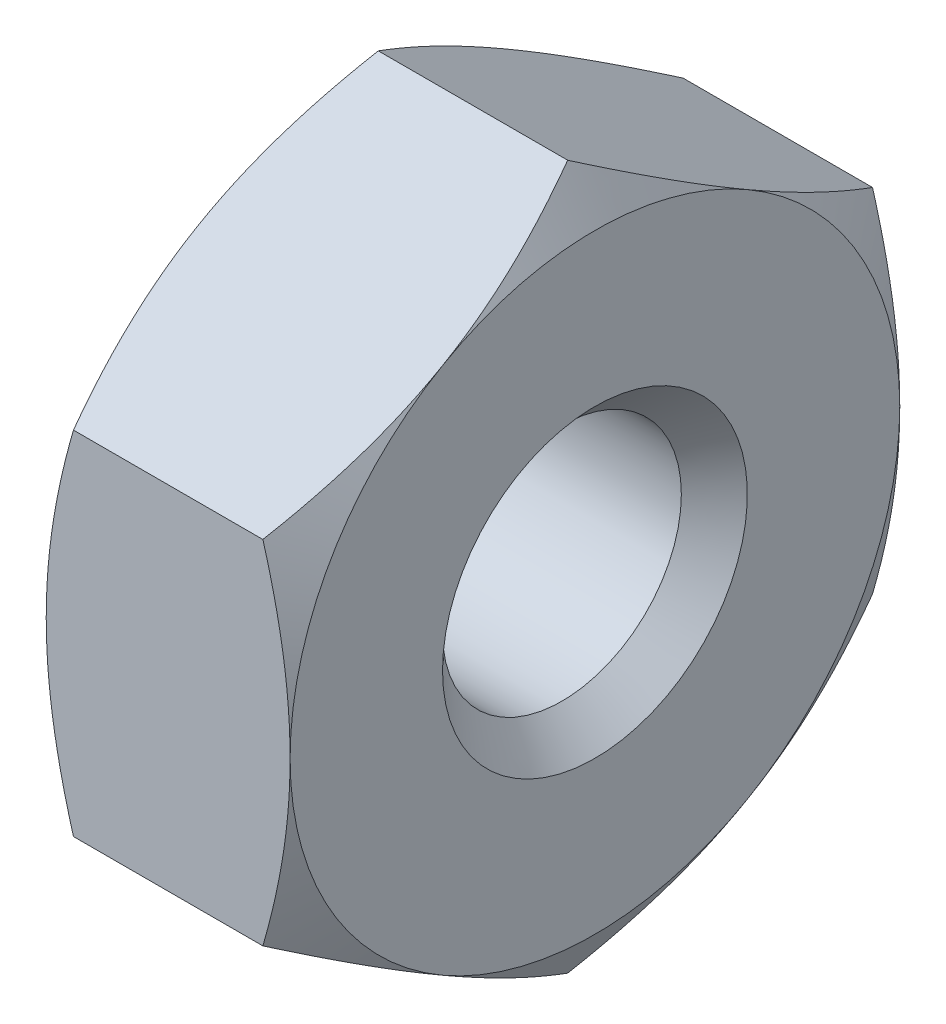
ISO-10303-21;
HEADER;
FILE_DESCRIPTION(('STEP AP214'),'2;1');
FILE_NAME('part.step','',(''),(''),'','','');
FILE_SCHEMA(('AUTOMOTIVE_DESIGN { 1 0 10303 214 1 1 1 1 }'));
ENDSEC;
DATA;
#1=APPLICATION_CONTEXT('core data for automotive mechanical design processes');
#2=APPLICATION_PROTOCOL_DEFINITION('international standard','automotive_design',2000,#1);
#3=PRODUCT_CONTEXT('',#1,'mechanical');
#4=PRODUCT('Part','Part','',(#3));
#5=PRODUCT_RELATED_PRODUCT_CATEGORY('part','',(#4));
#6=PRODUCT_DEFINITION_FORMATION('','',#4);
#7=PRODUCT_DEFINITION_CONTEXT('part definition',#1,'design');
#8=PRODUCT_DEFINITION('design','',#6,#7);
#9=PRODUCT_DEFINITION_SHAPE('','',#8);
#10=(LENGTH_UNIT() NAMED_UNIT(*) SI_UNIT(.MILLI.,.METRE.));
#11=(NAMED_UNIT(*) PLANE_ANGLE_UNIT() SI_UNIT($,.RADIAN.));
#12=(NAMED_UNIT(*) SI_UNIT($,.STERADIAN.) SOLID_ANGLE_UNIT());
#13=UNCERTAINTY_MEASURE_WITH_UNIT(LENGTH_MEASURE(1.E-05),#10,'distance_accuracy_value','');
#14=(GEOMETRIC_REPRESENTATION_CONTEXT(3) GLOBAL_UNCERTAINTY_ASSIGNED_CONTEXT((#13)) GLOBAL_UNIT_ASSIGNED_CONTEXT((#10,
#11,#12)) REPRESENTATION_CONTEXT('',''));
#15=CARTESIAN_POINT('',(0.,0.,0.));
#16=DIRECTION('',(0.,0.,1.));
#17=DIRECTION('',(1.,0.,0.));
#18=AXIS2_PLACEMENT_3D('',#15,#16,#17);
#19=CARTESIAN_POINT('',(0.,0.,0.));
#20=DIRECTION('',(1.,0.,0.));
#21=DIRECTION('',(0.,0.,-1.));
#22=AXIS2_PLACEMENT_3D('',#19,#20,#21);
#23=PLANE('',#22);
#24=CARTESIAN_POINT('',(0.,0.,0.));
#25=DIRECTION('',(-1.,0.,0.));
#26=DIRECTION('',(0.,0.,1.));
#27=AXIS2_PLACEMENT_3D('',#24,#25,#26);
#28=CIRCLE('',#27,2.);
#29=CARTESIAN_POINT('',(0.,0.,2.));
#30=VERTEX_POINT('',#29);
#31=CARTESIAN_POINT('',(0.,1.73205080756891,0.999999999999976));
#32=VERTEX_POINT('',#31);
#33=EDGE_CURVE('E11',#30,#32,#28,.T.);
#34=ORIENTED_EDGE('',*,*,#33,.T.);
#35=CARTESIAN_POINT('',(0.,1.73205080756891,-0.999999999999977));
#36=VERTEX_POINT('',#35);
#37=EDGE_CURVE('E41',#32,#36,#28,.T.);
#38=ORIENTED_EDGE('',*,*,#37,.T.);
#39=CARTESIAN_POINT('',(0.,0.,-2.));
#40=VERTEX_POINT('',#39);
#41=EDGE_CURVE('E141',#36,#40,#28,.T.);
#42=ORIENTED_EDGE('',*,*,#41,.T.);
#43=CARTESIAN_POINT('',(0.,-1.73205080756891,-0.999999999999976));
#44=VERTEX_POINT('',#43);
#45=EDGE_CURVE('E153',#40,#44,#28,.T.);
#46=ORIENTED_EDGE('',*,*,#45,.T.);
#47=CARTESIAN_POINT('',(0.,-1.73205080756891,0.999999999999977));
#48=VERTEX_POINT('',#47);
#49=EDGE_CURVE('E148',#44,#48,#28,.T.);
#50=ORIENTED_EDGE('',*,*,#49,.T.);
#51=EDGE_CURVE('E42',#48,#30,#28,.T.);
#52=ORIENTED_EDGE('',*,*,#51,.T.);
#53=EDGE_LOOP('',(#34,#38,#42,#46,#50,#52));
#54=FACE_BOUND('',#53,.T.);
#55=CARTESIAN_POINT('',(0.,0.,0.));
#56=DIRECTION('',(-1.,0.,0.));
#57=DIRECTION('',(0.,0.,1.));
#58=AXIS2_PLACEMENT_3D('',#55,#56,#57);
#59=CIRCLE('',#58,1.);
#60=CARTESIAN_POINT('',(0.,0.,1.));
#61=VERTEX_POINT('',#60);
#62=EDGE_CURVE('E491',#61,#61,#59,.T.);
#63=ORIENTED_EDGE('',*,*,#62,.F.);
#64=EDGE_LOOP('',(#63));
#65=FACE_BOUND('',#64,.T.);
#66=ADVANCED_FACE('F34',(#54,#65),#23,.F.);
#67=CARTESIAN_POINT('',(1.6,2.,0.));
#68=DIRECTION('',(-1.,0.,0.));
#69=DIRECTION('',(0.,0.,1.));
#70=AXIS2_PLACEMENT_3D('',#67,#68,#69);
#71=PLANE('',#70);
#72=CARTESIAN_POINT('',(1.6,0.,0.));
#73=DIRECTION('',(-1.,0.,0.));
#74=DIRECTION('',(0.,0.,1.));
#75=AXIS2_PLACEMENT_3D('',#72,#73,#74);
#76=CIRCLE('',#75,2.);
#77=CARTESIAN_POINT('',(1.6,0.,2.));
#78=VERTEX_POINT('',#77);
#79=CARTESIAN_POINT('',(1.6,1.73205080756891,0.999999999999976));
#80=VERTEX_POINT('',#79);
#81=EDGE_CURVE('E152',#78,#80,#76,.T.);
#82=ORIENTED_EDGE('',*,*,#81,.F.);
#83=CARTESIAN_POINT('',(1.6,-1.73205080756891,0.999999999999977));
#84=VERTEX_POINT('',#83);
#85=EDGE_CURVE('E156',#84,#78,#76,.T.);
#86=ORIENTED_EDGE('',*,*,#85,.F.);
#87=CARTESIAN_POINT('',(1.6,-1.73205080756891,-0.999999999999976));
#88=VERTEX_POINT('',#87);
#89=EDGE_CURVE('E165',#88,#84,#76,.T.);
#90=ORIENTED_EDGE('',*,*,#89,.F.);
#91=CARTESIAN_POINT('',(1.6,0.,-2.));
#92=VERTEX_POINT('',#91);
#93=EDGE_CURVE('E172',#92,#88,#76,.T.);
#94=ORIENTED_EDGE('',*,*,#93,.F.);
#95=CARTESIAN_POINT('',(1.6,1.73205080756891,-0.999999999999977));
#96=VERTEX_POINT('',#95);
#97=EDGE_CURVE('E162',#96,#92,#76,.T.);
#98=ORIENTED_EDGE('',*,*,#97,.F.);
#99=EDGE_CURVE('E155',#80,#96,#76,.T.);
#100=ORIENTED_EDGE('',*,*,#99,.F.);
#101=EDGE_LOOP('',(#82,#86,#90,#94,#98,#100));
#102=FACE_BOUND('',#101,.T.);
#103=CARTESIAN_POINT('',(1.6,0.,0.));
#104=DIRECTION('',(-1.,0.,0.));
#105=DIRECTION('',(0.,0.,1.));
#106=AXIS2_PLACEMENT_3D('',#103,#104,#105);
#107=CIRCLE('',#106,1.);
#108=CARTESIAN_POINT('',(1.6,0.,1.));
#109=VERTEX_POINT('',#108);
#110=EDGE_CURVE('E484',#109,#109,#107,.T.);
#111=ORIENTED_EDGE('',*,*,#110,.T.);
#112=EDGE_LOOP('',(#111));
#113=FACE_BOUND('',#112,.T.);
#114=ADVANCED_FACE('F195',(#102,#113),#71,.F.);
#115=CARTESIAN_POINT('',(0.23094010767585,0.,0.));
#116=DIRECTION('',(1.,0.,0.));
#117=DIRECTION('',(0.,0.,-1.));
#118=AXIS2_PLACEMENT_3D('',#115,#116,#117);
#119=CONICAL_SURFACE('',#118,2.4,1.0471975511966);
#120=CARTESIAN_POINT('',(0.960564620719933,-3.06969706647036,-2.));
#121=CARTESIAN_POINT('',(0.918447719225208,-2.9826070276099,-2.));
#122=CARTESIAN_POINT('',(0.876744016162863,-2.89531359514955,-2.));
#123=CARTESIAN_POINT('',(0.794396068040801,-2.7202116534341,-2.));
#124=CARTESIAN_POINT('',(0.753751996572019,-2.63240306263545,-2.));
#125=CARTESIAN_POINT('',(0.673544990993442,-2.45569454632309,-2.));
#126=CARTESIAN_POINT('',(0.633989435943704,-2.36679125959124,-2.));
#127=CARTESIAN_POINT('',(0.556540402154615,-2.18826628410374,-2.));
#128=CARTESIAN_POINT('',(0.518646842634758,-2.09864463051497,-2.));
#129=CARTESIAN_POINT('',(0.443829653550125,-1.91577344840977,-2.));
#130=CARTESIAN_POINT('',(0.406971478102181,-1.82249699059152,-2.));
#131=CARTESIAN_POINT('',(0.336122939262721,-1.6348410353351,-2.));
#132=CARTESIAN_POINT('',(0.302132902146455,-1.54046141378927,-2.));
#133=CARTESIAN_POINT('',(0.23793647872302,-1.35063624877528,-2.));
#134=CARTESIAN_POINT('',(0.207722147203833,-1.25519342016057,-2.));
#135=CARTESIAN_POINT('',(0.152067637871518,-1.06293935737291,-2.));
#136=CARTESIAN_POINT('',(0.126625921949113,-0.966128574914755,-2.));
#137=CARTESIAN_POINT('',(0.0818921981020604,-0.771614672106065,-2.));
#138=CARTESIAN_POINT('',(0.0625680611245456,-0.673919082405869,-2.));
#139=CARTESIAN_POINT('',(0.0311826829037339,-0.477348057700207,-2.));
#140=CARTESIAN_POINT('',(0.019120817656442,-0.378472724807819,-2.));
#141=CARTESIAN_POINT('',(0.00338395694954182,-0.181309994953057,-2.));
#142=CARTESIAN_POINT('',(-0.000396305644867935,-0.0830312460429947,-2.));
#143=CARTESIAN_POINT('',(0.000463238435134451,0.113485509919442,-2.));
#144=CARTESIAN_POINT('',(0.0051032754562111,0.211723515783711,-2.));
#145=CARTESIAN_POINT('',(0.0261043536527811,0.449358015625644,-2.));
#146=CARTESIAN_POINT('',(0.0466295476569,0.588388308666181,-2.));
#147=CARTESIAN_POINT('',(0.100865803906909,0.863858384666713,-2.));
#148=CARTESIAN_POINT('',(0.134590227817296,1.00029539521143,-2.));
#149=CARTESIAN_POINT('',(0.212402210305629,1.2733111237595,-2.));
#150=CARTESIAN_POINT('',(0.256698760305387,1.40982867525533,-2.));
#151=CARTESIAN_POINT('',(0.35218269853151,1.68033618831129,-2.));
#152=CARTESIAN_POINT('',(0.403368017200074,1.81432689526771,-2.));
#153=CARTESIAN_POINT('',(0.525435422837317,2.117419520614,-2.));
#154=CARTESIAN_POINT('',(0.59783250306695,2.28590501198163,-2.));
#155=CARTESIAN_POINT('',(0.747637620106175,2.62064677617018,-2.));
#156=CARTESIAN_POINT('',(0.825046777956453,2.78690254016494,-2.));
#157=CARTESIAN_POINT('',(0.983289343459741,3.11794960660753,-2.));
#158=CARTESIAN_POINT('',(1.06412572953733,3.28273947819276,-2.));
#159=CARTESIAN_POINT('',(1.22813169774068,3.61115513686861,-2.));
#160=CARTESIAN_POINT('',(1.31130135119586,3.77478088817925,-2.));
#161=CARTESIAN_POINT('',(1.47277008597423,4.0884514085166,-2.));
#162=CARTESIAN_POINT('',(1.55094370088272,4.23856092803469,-2.));
#163=CARTESIAN_POINT('',(1.70837218486806,4.53821671672572,-2.));
#164=CARTESIAN_POINT('',(1.78762708542198,4.68776296933911,-2.));
#165=CARTESIAN_POINT('',(1.94679238177092,4.98608322935775,-2.));
#166=CARTESIAN_POINT('',(2.02670095253288,5.13485821182457,-2.));
#167=CARTESIAN_POINT('',(2.18717495383285,5.43204425779157,-2.));
#168=CARTESIAN_POINT('',(2.26774035205521,5.5804553387338,-2.));
#169=CARTESIAN_POINT('',(2.3485529800385,5.72873071831092,-2.));
#170=B_SPLINE_CURVE_WITH_KNOTS('',3,(#120,#121,#122,#123,#124,#125,#126,#127,#128,#129,#130,
#131,#132,#133,#134,#135,#136,#137,#138,#139,#140,#141,#142,#143,#144,#145,#146,#147,#148,#149,
#150,#151,#152,#153,#154,#155,#156,#157,#158,#159,#160,#161,#162,#163,#164,#165,#166,#167,#168,
#169),.UNSPECIFIED.,.F.,.F.,(4,2,2,2,2,2,2,2,2,2,2,2,2,2,2,2,2,2,2,2,2,2,2,2,4),(0.,
0.290221855965844,0.580490961635766,0.872395030380332,1.16428489550747,1.46513250000125,
1.76601428247193,2.06625185869287,2.36639250807088,2.66492963544421,2.96344110762832,
3.25813564536262,3.55283824491541,3.97358015663303,4.39474909430442,4.82505701428419,
5.25523594641708,5.80524450910989,6.35537651886984,6.90599683350142,7.45663399931517,
7.96436452021779,8.47210985322803,8.97873847527003,9.48534232003251),.UNSPECIFIED.);
#171=CARTESIAN_POINT('',(0.178632794954096,-1.1547005383793,-2.));
#172=VERTEX_POINT('',#171);
#173=EDGE_CURVE('E277',#40,#172,#170,.F.);
#174=ORIENTED_EDGE('',*,*,#173,.T.);
#175=CARTESIAN_POINT('',(0.178699466620512,-1.15458506832546,-2.0002));
#176=CARTESIAN_POINT('',(0.149389536100693,-1.20532911262023,-1.91230873709994));
#177=CARTESIAN_POINT('',(0.12273285198048,-1.25651117447785,-1.82365880552641));
#178=CARTESIAN_POINT('',(0.0762024910207341,-1.35976164019324,-1.64482375300219));
#179=CARTESIAN_POINT('',(0.0563452763827919,-1.41183187919149,-1.55463545349495));
#180=CARTESIAN_POINT('',(0.0254334640232647,-1.51532701829187,-1.37537661423668));
#181=CARTESIAN_POINT('',(0.0141731515985431,-1.56673599086582,-1.28633366177368));
#182=CARTESIAN_POINT('',(0.000728662594653389,-1.66979593505377,-1.10782860221494));
#183=CARTESIAN_POINT('',(-0.00146664504652047,-1.72144653186535,-1.01836714429602));
#184=CARTESIAN_POINT('',(0.00309098933066007,-1.81796535054797,-0.851191646451181));
#185=CARTESIAN_POINT('',(0.0087248746870256,-1.86284799277606,-0.773452629734197));
#186=CARTESIAN_POINT('',(0.0265838952608381,-1.95232085557727,-0.618481085463851));
#187=CARTESIAN_POINT('',(0.0388151360234481,-1.99691076648956,-0.541249094258788));
#188=CARTESIAN_POINT('',(0.0693934368676162,-2.08656822922817,-0.38595781351779));
#189=CARTESIAN_POINT('',(0.0878701670657209,-2.13162442866768,-0.307918186892613));
#190=CARTESIAN_POINT('',(0.129805518212858,-2.221064675979,-0.153003134307861));
#191=CARTESIAN_POINT('',(0.153254280492314,-2.26544987045196,-0.076125722376878));
#192=CARTESIAN_POINT('',(0.178699466620497,-2.30951654681234,0.000199999999999941));
#193=B_SPLINE_CURVE_WITH_KNOTS('',3,(#175,#176,#177,#178,#179,#180,#181,#182,#183,#184,#185,
#186,#187,#188,#189,#190,#191,#192),.UNSPECIFIED.,.F.,.F.,(4,2,2,2,2,2,2,2,4),(0.,
0.317031824695613,0.63482587634657,0.944753967652646,1.25430138000373,1.52387047293094,
1.79368946861028,2.06949491027632,2.3447585082147),.UNSPECIFIED.);
#194=EDGE_CURVE('E244',#172,#44,#193,.T.);
#195=ORIENTED_EDGE('',*,*,#194,.T.);
#196=ORIENTED_EDGE('',*,*,#45,.F.);
#197=EDGE_LOOP('',(#174,#195,#196));
#198=FACE_BOUND('',#197,.T.);
#199=ADVANCED_FACE('F198',(#198),#119,.T.);
#200=ORIENTED_EDGE('',*,*,#49,.F.);
#201=CARTESIAN_POINT('',(0.17863279495408,-2.3094010767585,0.));
#202=VERTEX_POINT('',#201);
#203=EDGE_CURVE('E245',#44,#202,#193,.T.);
#204=ORIENTED_EDGE('',*,*,#203,.T.);
#205=CARTESIAN_POINT('',(0.178699466620497,-2.30951654681234,-0.0002));
#206=CARTESIAN_POINT('',(0.149389536100679,-2.25877250251757,0.0876912629000611));
#207=CARTESIAN_POINT('',(0.122732851980468,-2.20759044065996,0.176341194473594));
#208=CARTESIAN_POINT('',(0.0762024910207237,-2.10433997494457,0.355176246997806));
#209=CARTESIAN_POINT('',(0.0563452763827828,-2.05226973594631,0.445364546505042));
#210=CARTESIAN_POINT('',(0.0254334640232587,-1.94877459684593,0.624623385763314));
#211=CARTESIAN_POINT('',(0.0141731515985388,-1.89736562427198,0.713666338226313));
#212=CARTESIAN_POINT('',(0.000728662594652176,-1.79430568008404,0.892171397785054));
#213=CARTESIAN_POINT('',(-0.00146664504652041,-1.74265508327246,0.98163285570397));
#214=CARTESIAN_POINT('',(0.00309098933066239,-1.64613626458983,1.14880835354881));
#215=CARTESIAN_POINT('',(0.00872487468702908,-1.60125362236175,1.22654737026579));
#216=CARTESIAN_POINT('',(0.026583895260844,-1.51178075956053,1.38151891453614));
#217=CARTESIAN_POINT('',(0.0388151360234552,-1.46719084864824,1.45875090574121));
#218=CARTESIAN_POINT('',(0.0693934368676259,-1.37753338590963,1.61404218648221));
#219=CARTESIAN_POINT('',(0.087870167065732,-1.33247718647013,1.69208181310738));
#220=CARTESIAN_POINT('',(0.129805518212872,-1.2430369391588,1.84699686569214));
#221=CARTESIAN_POINT('',(0.153254280492329,-1.19865174468584,1.92387427762312));
#222=CARTESIAN_POINT('',(0.178699466620512,-1.15458506832546,2.0002));
#223=B_SPLINE_CURVE_WITH_KNOTS('',3,(#205,#206,#207,#208,#209,#210,#211,#212,#213,#214,#215,
#216,#217,#218,#219,#220,#221,#222),.UNSPECIFIED.,.F.,.F.,(4,2,2,2,2,2,2,2,4),(0.,
0.31703182469561,0.634825876346563,0.944753967652636,1.25430138000371,1.52387047293093,
1.79368946861027,2.06949491027632,2.3447585082147),.UNSPECIFIED.);
#224=EDGE_CURVE('E253',#202,#48,#223,.T.);
#225=ORIENTED_EDGE('',*,*,#224,.T.);
#226=EDGE_LOOP('',(#200,#204,#225));
#227=FACE_BOUND('',#226,.T.);
#228=ADVANCED_FACE('F316',(#227),#119,.T.);
#229=ORIENTED_EDGE('',*,*,#51,.F.);
#230=CARTESIAN_POINT('',(0.178632794954096,-1.1547005383793,2.));
#231=VERTEX_POINT('',#230);
#232=EDGE_CURVE('E249',#48,#231,#223,.T.);
#233=ORIENTED_EDGE('',*,*,#232,.T.);
#234=CARTESIAN_POINT('',(0.960564620719933,-3.06969706647036,2.));
#235=CARTESIAN_POINT('',(0.918447719225208,-2.9826070276099,2.));
#236=CARTESIAN_POINT('',(0.876744016162863,-2.89531359514955,2.));
#237=CARTESIAN_POINT('',(0.794396068040801,-2.7202116534341,2.));
#238=CARTESIAN_POINT('',(0.753751996572019,-2.63240306263545,2.));
#239=CARTESIAN_POINT('',(0.673544990993442,-2.45569454632309,2.));
#240=CARTESIAN_POINT('',(0.633989435943704,-2.36679125959124,2.));
#241=CARTESIAN_POINT('',(0.556540402154615,-2.18826628410374,2.));
#242=CARTESIAN_POINT('',(0.518646842634758,-2.09864463051497,2.));
#243=CARTESIAN_POINT('',(0.443829653550125,-1.91577344840977,2.));
#244=CARTESIAN_POINT('',(0.406971478102181,-1.82249699059152,2.));
#245=CARTESIAN_POINT('',(0.336122939262721,-1.6348410353351,2.));
#246=CARTESIAN_POINT('',(0.302132902146455,-1.54046141378927,2.));
#247=CARTESIAN_POINT('',(0.23793647872302,-1.35063624877528,2.));
#248=CARTESIAN_POINT('',(0.207722147203833,-1.25519342016057,2.));
#249=CARTESIAN_POINT('',(0.152067637871518,-1.06293935737291,2.));
#250=CARTESIAN_POINT('',(0.126625921949113,-0.966128574914755,2.));
#251=CARTESIAN_POINT('',(0.0818921981020604,-0.771614672106065,2.));
#252=CARTESIAN_POINT('',(0.0625680611245456,-0.673919082405869,2.));
#253=CARTESIAN_POINT('',(0.0311826829037339,-0.477348057700207,2.));
#254=CARTESIAN_POINT('',(0.019120817656442,-0.378472724807819,2.));
#255=CARTESIAN_POINT('',(0.00338395694954182,-0.181309994953057,2.));
#256=CARTESIAN_POINT('',(-0.000396305644867935,-0.0830312460429947,2.));
#257=CARTESIAN_POINT('',(0.000463238435134451,0.113485509919442,2.));
#258=CARTESIAN_POINT('',(0.0051032754562111,0.211723515783711,2.));
#259=CARTESIAN_POINT('',(0.0261043536527811,0.449358015625644,2.));
#260=CARTESIAN_POINT('',(0.0466295476569,0.588388308666181,2.));
#261=CARTESIAN_POINT('',(0.100865803906909,0.863858384666713,2.));
#262=CARTESIAN_POINT('',(0.134590227817296,1.00029539521143,2.));
#263=CARTESIAN_POINT('',(0.212402210305629,1.2733111237595,2.));
#264=CARTESIAN_POINT('',(0.256698760305387,1.40982867525533,2.));
#265=CARTESIAN_POINT('',(0.35218269853151,1.68033618831129,2.));
#266=CARTESIAN_POINT('',(0.403368017200074,1.81432689526771,2.));
#267=CARTESIAN_POINT('',(0.525435422837317,2.117419520614,2.));
#268=CARTESIAN_POINT('',(0.59783250306695,2.28590501198163,2.));
#269=CARTESIAN_POINT('',(0.747637620106175,2.62064677617018,2.));
#270=CARTESIAN_POINT('',(0.825046777956453,2.78690254016494,2.));
#271=CARTESIAN_POINT('',(0.983289343459741,3.11794960660753,2.));
#272=CARTESIAN_POINT('',(1.06412572953733,3.28273947819276,2.));
#273=CARTESIAN_POINT('',(1.22813169774068,3.61115513686861,2.));
#274=CARTESIAN_POINT('',(1.31130135119586,3.77478088817925,2.));
#275=CARTESIAN_POINT('',(1.47277008597423,4.0884514085166,2.));
#276=CARTESIAN_POINT('',(1.55094370088272,4.23856092803469,2.));
#277=CARTESIAN_POINT('',(1.70837218486806,4.53821671672572,2.));
#278=CARTESIAN_POINT('',(1.78762708542198,4.68776296933911,2.));
#279=CARTESIAN_POINT('',(1.94679238177092,4.98608322935775,2.));
#280=CARTESIAN_POINT('',(2.02670095253288,5.13485821182457,2.));
#281=CARTESIAN_POINT('',(2.18717495383285,5.43204425779157,2.));
#282=CARTESIAN_POINT('',(2.26774035205521,5.5804553387338,2.));
#283=CARTESIAN_POINT('',(2.3485529800385,5.72873071831092,2.));
#284=B_SPLINE_CURVE_WITH_KNOTS('',3,(#234,#235,#236,#237,#238,#239,#240,#241,#242,#243,#244,
#245,#246,#247,#248,#249,#250,#251,#252,#253,#254,#255,#256,#257,#258,#259,#260,#261,#262,#263,
#264,#265,#266,#267,#268,#269,#270,#271,#272,#273,#274,#275,#276,#277,#278,#279,#280,#281,#282,
#283),.UNSPECIFIED.,.F.,.F.,(4,2,2,2,2,2,2,2,2,2,2,2,2,2,2,2,2,2,2,2,2,2,2,2,4),(0.,
0.290221855965844,0.580490961635766,0.872395030380332,1.16428489550747,1.46513250000125,
1.76601428247193,2.06625185869287,2.36639250807088,2.66492963544421,2.96344110762832,
3.25813564536262,3.55283824491541,3.97358015663303,4.39474909430442,4.82505701428419,
5.25523594641708,5.80524450910989,6.35537651886984,6.90599683350142,7.45663399931517,
7.96436452021779,8.47210985322803,8.97873847527003,9.48534232003251),.UNSPECIFIED.);
#285=EDGE_CURVE('E166',#231,#30,#284,.T.);
#286=ORIENTED_EDGE('',*,*,#285,.T.);
#287=EDGE_LOOP('',(#229,#233,#286));
#288=FACE_BOUND('',#287,.T.);
#289=ADVANCED_FACE('F323',(#288),#119,.T.);
#290=CARTESIAN_POINT('',(0.178699466620497,2.30951654681234,0.0002));
#291=CARTESIAN_POINT('',(0.149389536100679,2.25877250251757,-0.0876912629000611));
#292=CARTESIAN_POINT('',(0.122732851980468,2.20759044065996,-0.176341194473594));
#293=CARTESIAN_POINT('',(0.0762024910207237,2.10433997494457,-0.355176246997806));
#294=CARTESIAN_POINT('',(0.0563452763827828,2.05226973594631,-0.445364546505042));
#295=CARTESIAN_POINT('',(0.0254334640232587,1.94877459684593,-0.624623385763314));
#296=CARTESIAN_POINT('',(0.0141731515985388,1.89736562427198,-0.713666338226313));
#297=CARTESIAN_POINT('',(0.000728662594652176,1.79430568008404,-0.892171397785054));
#298=CARTESIAN_POINT('',(-0.00146664504652041,1.74265508327246,-0.98163285570397));
#299=CARTESIAN_POINT('',(0.00309098933066239,1.64613626458983,-1.14880835354881));
#300=CARTESIAN_POINT('',(0.00872487468702908,1.60125362236175,-1.22654737026579));
#301=CARTESIAN_POINT('',(0.026583895260844,1.51178075956053,-1.38151891453614));
#302=CARTESIAN_POINT('',(0.0388151360234552,1.46719084864824,-1.45875090574121));
#303=CARTESIAN_POINT('',(0.0693934368676259,1.37753338590963,-1.61404218648221));
#304=CARTESIAN_POINT('',(0.087870167065732,1.33247718647013,-1.69208181310738));
#305=CARTESIAN_POINT('',(0.129805518212872,1.2430369391588,-1.84699686569214));
#306=CARTESIAN_POINT('',(0.153254280492329,1.19865174468584,-1.92387427762312));
#307=CARTESIAN_POINT('',(0.178699466620512,1.15458506832546,-2.0002));
#308=B_SPLINE_CURVE_WITH_KNOTS('',3,(#290,#291,#292,#293,#294,#295,#296,#297,#298,#299,#300,
#301,#302,#303,#304,#305,#306,#307),.UNSPECIFIED.,.F.,.F.,(4,2,2,2,2,2,2,2,4),(0.,
0.31703182469561,0.634825876346563,0.944753967652636,1.25430138000371,1.52387047293093,
1.79368946861027,2.06949491027632,2.3447585082147),.UNSPECIFIED.);
#309=CARTESIAN_POINT('',(0.178632794954096,1.1547005383793,-2.));
#310=VERTEX_POINT('',#309);
#311=EDGE_CURVE('E510',#36,#310,#308,.T.);
#312=ORIENTED_EDGE('',*,*,#311,.T.);
#313=EDGE_CURVE('E273',#310,#40,#170,.F.);
#314=ORIENTED_EDGE('',*,*,#313,.T.);
#315=ORIENTED_EDGE('',*,*,#41,.F.);
#316=EDGE_LOOP('',(#312,#314,#315));
#317=FACE_BOUND('',#316,.T.);
#318=ADVANCED_FACE('F330',(#317),#119,.T.);
#319=ORIENTED_EDGE('',*,*,#33,.F.);
#320=CARTESIAN_POINT('',(0.178632794954096,1.1547005383793,2.));
#321=VERTEX_POINT('',#320);
#322=EDGE_CURVE('E133',#30,#321,#284,.T.);
#323=ORIENTED_EDGE('',*,*,#322,.T.);
#324=CARTESIAN_POINT('',(0.178699466620512,1.15458506832546,2.0002));
#325=CARTESIAN_POINT('',(0.149389536100693,1.20532911262023,1.91230873709994));
#326=CARTESIAN_POINT('',(0.12273285198048,1.25651117447785,1.82365880552641));
#327=CARTESIAN_POINT('',(0.0762024910207341,1.35976164019324,1.64482375300219));
#328=CARTESIAN_POINT('',(0.0563452763827919,1.41183187919149,1.55463545349495));
#329=CARTESIAN_POINT('',(0.0254334640232647,1.51532701829187,1.37537661423668));
#330=CARTESIAN_POINT('',(0.0141731515985431,1.56673599086582,1.28633366177368));
#331=CARTESIAN_POINT('',(0.000728662594653389,1.66979593505377,1.10782860221494));
#332=CARTESIAN_POINT('',(-0.00146664504652047,1.72144653186535,1.01836714429602));
#333=CARTESIAN_POINT('',(0.00309098933066007,1.81796535054797,0.851191646451181));
#334=CARTESIAN_POINT('',(0.0087248746870256,1.86284799277606,0.773452629734197));
#335=CARTESIAN_POINT('',(0.0265838952608381,1.95232085557727,0.618481085463851));
#336=CARTESIAN_POINT('',(0.0388151360234481,1.99691076648956,0.541249094258788));
#337=CARTESIAN_POINT('',(0.0693934368676162,2.08656822922817,0.38595781351779));
#338=CARTESIAN_POINT('',(0.0878701670657209,2.13162442866768,0.307918186892613));
#339=CARTESIAN_POINT('',(0.129805518212858,2.221064675979,0.153003134307861));
#340=CARTESIAN_POINT('',(0.153254280492314,2.26544987045196,0.076125722376878));
#341=CARTESIAN_POINT('',(0.178699466620497,2.30951654681234,-0.000199999999999941));
#342=B_SPLINE_CURVE_WITH_KNOTS('',3,(#324,#325,#326,#327,#328,#329,#330,#331,#332,#333,#334,
#335,#336,#337,#338,#339,#340,#341),.UNSPECIFIED.,.F.,.F.,(4,2,2,2,2,2,2,2,4),(0.,
0.317031824695613,0.63482587634657,0.944753967652646,1.25430138000373,1.52387047293094,
1.79368946861028,2.06949491027632,2.3447585082147),.UNSPECIFIED.);
#343=EDGE_CURVE('E123',#321,#32,#342,.T.);
#344=ORIENTED_EDGE('',*,*,#343,.T.);
#345=EDGE_LOOP('',(#319,#323,#344));
#346=FACE_BOUND('',#345,.T.);
#347=ADVANCED_FACE('F132',(#346),#119,.T.);
#348=CARTESIAN_POINT('',(0.17863279495408,2.3094010767585,0.));
#349=VERTEX_POINT('',#348);
#350=EDGE_CURVE('E120',#32,#349,#342,.T.);
#351=ORIENTED_EDGE('',*,*,#350,.T.);
#352=EDGE_CURVE('E137',#349,#36,#308,.T.);
#353=ORIENTED_EDGE('',*,*,#352,.T.);
#354=ORIENTED_EDGE('',*,*,#37,.F.);
#355=EDGE_LOOP('',(#351,#353,#354));
#356=FACE_BOUND('',#355,.T.);
#357=ADVANCED_FACE('F136',(#356),#119,.T.);
#358=CARTESIAN_POINT('',(1.6,1.1547005383793,2.));
#359=DIRECTION('',(0.,0.,-1.));
#360=DIRECTION('',(-1.,0.,0.));
#361=AXIS2_PLACEMENT_3D('',#358,#359,#360);
#362=PLANE('',#361);
#363=DIRECTION('',(-1.,0.,0.));
#364=VECTOR('',#363,1.);
#365=CARTESIAN_POINT('',(1.6,-1.1547005383793,2.));
#366=LINE('',#365,#364);
#367=CARTESIAN_POINT('',(1.42136720504594,-1.1547005383793,2.));
#368=VERTEX_POINT('',#367);
#369=EDGE_CURVE('E503',#368,#231,#366,.T.);
#370=ORIENTED_EDGE('',*,*,#369,.F.);
#371=CARTESIAN_POINT('',(0.639435379280275,-3.06969706647035,2.));
#372=CARTESIAN_POINT('',(0.681552280774991,-2.9826070276099,2.));
#373=CARTESIAN_POINT('',(0.723255983837329,-2.89531359514955,2.));
#374=CARTESIAN_POINT('',(0.805603931959375,-2.7202116534341,2.));
#375=CARTESIAN_POINT('',(0.846248003428148,-2.63240306263544,2.));
#376=CARTESIAN_POINT('',(0.926455009006709,-2.45569454632308,2.));
#377=CARTESIAN_POINT('',(0.966010564056439,-2.36679125959122,2.));
#378=CARTESIAN_POINT('',(1.04345959784551,-2.18826628410372,2.));
#379=CARTESIAN_POINT('',(1.08135315736536,-2.09864463051495,2.));
#380=CARTESIAN_POINT('',(1.15617034644998,-1.91577344840975,2.));
#381=CARTESIAN_POINT('',(1.19302852189791,-1.82249699059151,2.));
#382=CARTESIAN_POINT('',(1.26387706073736,-1.63484103533508,2.));
#383=CARTESIAN_POINT('',(1.29786709785361,-1.54046141378926,2.));
#384=CARTESIAN_POINT('',(1.36206352127704,-1.35063624877527,2.));
#385=CARTESIAN_POINT('',(1.39227785279622,-1.25519342016056,2.));
#386=CARTESIAN_POINT('',(1.44793236212852,-1.0629393573729,2.));
#387=CARTESIAN_POINT('',(1.47337407805092,-0.966128574914751,2.));
#388=CARTESIAN_POINT('',(1.51810780189796,-0.771614672106066,2.));
#389=CARTESIAN_POINT('',(1.53743193887547,-0.673919082405873,2.));
#390=CARTESIAN_POINT('',(1.56881731709627,-0.477348057700216,2.));
#391=CARTESIAN_POINT('',(1.58087918234356,-0.378472724807832,2.));
#392=CARTESIAN_POINT('',(1.59661604305046,-0.181309994953076,2.));
#393=CARTESIAN_POINT('',(1.60039630564487,-0.0830312460430169,2.));
#394=CARTESIAN_POINT('',(1.59953676156487,0.113485509919414,2.));
#395=CARTESIAN_POINT('',(1.59489672454379,0.21172351578368,2.));
#396=CARTESIAN_POINT('',(1.57389564634723,0.449358015625645,2.));
#397=CARTESIAN_POINT('',(1.55337045234311,0.588388308666217,2.));
#398=CARTESIAN_POINT('',(1.49913419609309,0.863858384666819,2.));
#399=CARTESIAN_POINT('',(1.4654097721827,1.00029539521157,2.));
#400=CARTESIAN_POINT('',(1.38759778969435,1.27331112375971,2.));
#401=CARTESIAN_POINT('',(1.34330123969459,1.40982867525558,2.));
#402=CARTESIAN_POINT('',(1.24781730146845,1.6803361883116,2.));
#403=CARTESIAN_POINT('',(1.19663198279988,1.81432689526806,2.));
#404=CARTESIAN_POINT('',(1.07456457716264,2.11741952061438,2.));
#405=CARTESIAN_POINT('',(1.00216749693301,2.28590501198201,2.));
#406=CARTESIAN_POINT('',(0.852362379893811,2.62064677617057,2.));
#407=CARTESIAN_POINT('',(0.774953222043546,2.78690254016532,2.));
#408=CARTESIAN_POINT('',(0.616710656540284,3.11794960660791,2.));
#409=CARTESIAN_POINT('',(0.535874270462706,3.28273947819314,2.));
#410=CARTESIAN_POINT('',(0.371868302259383,3.611155136869,2.));
#411=CARTESIAN_POINT('',(0.288698648804225,3.77478088817965,2.));
#412=CARTESIAN_POINT('',(0.127229914025874,4.08845140851701,2.));
#413=CARTESIAN_POINT('',(0.0490562991173974,4.23856092803511,2.));
#414=CARTESIAN_POINT('',(-0.108372184867915,4.53821671672615,2.));
#415=CARTESIAN_POINT('',(-0.187627085421829,4.68776296933954,2.));
#416=CARTESIAN_POINT('',(-0.346792381770743,4.9860832293582,2.));
#417=CARTESIAN_POINT('',(-0.426700952532691,5.13485821182503,2.));
#418=CARTESIAN_POINT('',(-0.587174953832628,5.43204425779205,2.));
#419=CARTESIAN_POINT('',(-0.667740352054977,5.58045533873428,2.));
#420=CARTESIAN_POINT('',(-0.748552980038259,5.7287307183114,2.));
#421=B_SPLINE_CURVE_WITH_KNOTS('',3,(#371,#372,#373,#374,#375,#376,#377,#378,#379,#380,#381,
#382,#383,#384,#385,#386,#387,#388,#389,#390,#391,#392,#393,#394,#395,#396,#397,#398,#399,#400,
#401,#402,#403,#404,#405,#406,#407,#408,#409,#410,#411,#412,#413,#414,#415,#416,#417,#418,#419,
#420),.UNSPECIFIED.,.F.,.F.,(4,2,2,2,2,2,2,2,2,2,2,2,2,2,2,2,2,2,2,2,2,2,2,2,4),(0.,
0.290221855965838,0.580490961635753,0.872395030380313,1.16428489550745,1.46513250000121,
1.76601428247188,2.06625185869281,2.36639250807081,2.66492963544413,2.96344110762824,
3.25813564536252,3.5528382449153,3.97358015663302,4.39474909430452,4.8250570142844,
5.25523594641739,5.80524450911019,6.35537651887013,6.90599683350169,7.45663399931543,
7.96436452021805,8.4721098532283,8.9787384752703,9.48534232003278),.UNSPECIFIED.);
#422=EDGE_CURVE('E179',#78,#368,#421,.F.);
#423=ORIENTED_EDGE('',*,*,#422,.F.);
#424=CARTESIAN_POINT('',(1.42136720504594,1.1547005383793,2.));
#425=VERTEX_POINT('',#424);
#426=EDGE_CURVE('E173',#425,#78,#421,.F.);
#427=ORIENTED_EDGE('',*,*,#426,.F.);
#428=DIRECTION('',(-1.,0.,0.));
#429=VECTOR('',#428,1.);
#430=CARTESIAN_POINT('',(1.6,1.1547005383793,2.));
#431=LINE('',#430,#429);
#432=EDGE_CURVE('E56',#425,#321,#431,.T.);
#433=ORIENTED_EDGE('',*,*,#432,.T.);
#434=ORIENTED_EDGE('',*,*,#322,.F.);
#435=ORIENTED_EDGE('',*,*,#285,.F.);
#436=EDGE_LOOP('',(#370,#423,#427,#433,#434,#435));
#437=FACE_BOUND('',#436,.T.);
#438=ADVANCED_FACE('F186',(#437),#362,.F.);
#439=CARTESIAN_POINT('',(1.6,-1.1547005383793,2.));
#440=DIRECTION('',(0.,0.866025403784448,-0.499999999999983));
#441=DIRECTION('',(0.,0.499999999999983,0.866025403784448));
#442=AXIS2_PLACEMENT_3D('',#439,#440,#441);
#443=PLANE('',#442);
#444=DIRECTION('',(-1.,0.,0.));
#445=VECTOR('',#444,1.);
#446=CARTESIAN_POINT('',(1.6,-2.3094010767585,0.));
#447=LINE('',#446,#445);
#448=CARTESIAN_POINT('',(1.42136720504596,-2.3094010767585,0.));
#449=VERTEX_POINT('',#448);
#450=EDGE_CURVE('E502',#449,#202,#447,.T.);
#451=ORIENTED_EDGE('',*,*,#450,.F.);
#452=CARTESIAN_POINT('',(1.42130053337953,-1.15458506832546,2.0002));
#453=CARTESIAN_POINT('',(1.45061046389934,-1.20532911262023,1.91230873709994));
#454=CARTESIAN_POINT('',(1.47726714801955,-1.25651117447784,1.82365880552641));
#455=CARTESIAN_POINT('',(1.52379750897928,-1.35976164019323,1.6448237530022));
#456=CARTESIAN_POINT('',(1.54365472361722,-1.41183187919149,1.55463545349497));
#457=CARTESIAN_POINT('',(1.57456653597674,-1.51532701829186,1.3753766142367));
#458=CARTESIAN_POINT('',(1.58582684840146,-1.56673599086581,1.2863336617737));
#459=CARTESIAN_POINT('',(1.59927133740535,-1.66979593505375,1.10782860221496));
#460=CARTESIAN_POINT('',(1.60146664504652,-1.72144653186533,1.01836714429605));
#461=CARTESIAN_POINT('',(1.59690901066934,-1.81796535054796,0.851191646451206));
#462=CARTESIAN_POINT('',(1.59127512531298,-1.86284799277604,0.773452629734221));
#463=CARTESIAN_POINT('',(1.57341610473917,-1.95232085557726,0.61848108546387));
#464=CARTESIAN_POINT('',(1.56118486397656,-1.99691076648955,0.541249094258805));
#465=CARTESIAN_POINT('',(1.5306065631324,-2.08656822922817,0.385957813517802));
#466=CARTESIAN_POINT('',(1.5121298329343,-2.13162442866767,0.307918186892623));
#467=CARTESIAN_POINT('',(1.47019448178717,-2.221064675979,0.153003134307867));
#468=CARTESIAN_POINT('',(1.44674571950772,-2.26544987045196,0.0761257223768809));
#469=CARTESIAN_POINT('',(1.42130053337954,-2.30951654681234,-0.000200000000000196));
#470=B_SPLINE_CURVE_WITH_KNOTS('',3,(#452,#453,#454,#455,#456,#457,#458,#459,#460,#461,#462,
#463,#464,#465,#466,#467,#468,#469),.UNSPECIFIED.,.F.,.F.,(4,2,2,2,2,2,2,2,4),(0.,
0.317031824695602,0.634825876346547,0.944753967652614,1.25430138000369,1.52387047293091,
1.79368946861025,2.0694949102763,2.34475850821468),.UNSPECIFIED.);
#471=EDGE_CURVE('E238',#84,#449,#470,.T.);
#472=ORIENTED_EDGE('',*,*,#471,.F.);
#473=EDGE_CURVE('E243',#368,#84,#470,.T.);
#474=ORIENTED_EDGE('',*,*,#473,.F.);
#475=ORIENTED_EDGE('',*,*,#369,.T.);
#476=ORIENTED_EDGE('',*,*,#232,.F.);
#477=ORIENTED_EDGE('',*,*,#224,.F.);
#478=EDGE_LOOP('',(#451,#472,#474,#475,#476,#477));
#479=FACE_BOUND('',#478,.T.);
#480=ADVANCED_FACE('F191',(#479),#443,.F.);
#481=CARTESIAN_POINT('',(1.6,-2.3094010767585,0.));
#482=DIRECTION('',(0.,0.866025403784448,0.499999999999983));
#483=DIRECTION('',(0.,-0.499999999999983,0.866025403784448));
#484=AXIS2_PLACEMENT_3D('',#481,#482,#483);
#485=PLANE('',#484);
#486=DIRECTION('',(-1.,0.,0.));
#487=VECTOR('',#486,1.);
#488=CARTESIAN_POINT('',(1.6,-1.1547005383793,-2.));
#489=LINE('',#488,#487);
#490=CARTESIAN_POINT('',(1.42136720504594,-1.1547005383793,-2.));
#491=VERTEX_POINT('',#490);
#492=EDGE_CURVE('E499',#491,#172,#489,.T.);
#493=ORIENTED_EDGE('',*,*,#492,.F.);
#494=CARTESIAN_POINT('',(1.42130053337954,-2.30951654681234,0.000200000000000034));
#495=CARTESIAN_POINT('',(1.45061046389935,-2.25877250251758,-0.0876912629000596));
#496=CARTESIAN_POINT('',(1.47726714801956,-2.20759044065996,-0.17634119447359));
#497=CARTESIAN_POINT('',(1.52379750897929,-2.10433997494457,-0.355176246997798));
#498=CARTESIAN_POINT('',(1.54365472361723,-2.05226973594632,-0.445364546505031));
#499=CARTESIAN_POINT('',(1.57456653597674,-1.94877459684594,-0.624623385763297));
#500=CARTESIAN_POINT('',(1.58582684840146,-1.89736562427199,-0.713666338226294));
#501=CARTESIAN_POINT('',(1.59927133740535,-1.79430568008405,-0.892171397785031));
#502=CARTESIAN_POINT('',(1.60146664504652,-1.74265508327247,-0.981632855703944));
#503=CARTESIAN_POINT('',(1.59690901066934,-1.64613626458985,-1.14880835354878));
#504=CARTESIAN_POINT('',(1.59127512531298,-1.60125362236176,-1.22654737026577));
#505=CARTESIAN_POINT('',(1.57341610473917,-1.51178075956055,-1.38151891453612));
#506=CARTESIAN_POINT('',(1.56118486397656,-1.46719084864825,-1.45875090574119));
#507=CARTESIAN_POINT('',(1.53060656313239,-1.37753338590963,-1.61404218648219));
#508=CARTESIAN_POINT('',(1.51212983293429,-1.33247718647013,-1.69208181310737));
#509=CARTESIAN_POINT('',(1.47019448178716,-1.2430369391588,-1.84699686569213));
#510=CARTESIAN_POINT('',(1.44674571950771,-1.19865174468585,-1.92387427762312));
#511=CARTESIAN_POINT('',(1.42130053337953,-1.15458506832546,-2.0002));
#512=B_SPLINE_CURVE_WITH_KNOTS('',3,(#494,#495,#496,#497,#498,#499,#500,#501,#502,#503,#504,
#505,#506,#507,#508,#509,#510,#511),.UNSPECIFIED.,.F.,.F.,(4,2,2,2,2,2,2,2,4),(0.,
0.317031824695598,0.63482587634654,0.944753967652604,1.25430138000367,1.5238704729309,
1.79368946861024,2.0694949102763,2.34475850821468),.UNSPECIFIED.);
#513=EDGE_CURVE('E232',#88,#491,#512,.T.);
#514=ORIENTED_EDGE('',*,*,#513,.F.);
#515=EDGE_CURVE('E267',#449,#88,#512,.T.);
#516=ORIENTED_EDGE('',*,*,#515,.F.);
#517=ORIENTED_EDGE('',*,*,#450,.T.);
#518=ORIENTED_EDGE('',*,*,#203,.F.);
#519=ORIENTED_EDGE('',*,*,#194,.F.);
#520=EDGE_LOOP('',(#493,#514,#516,#517,#518,#519));
#521=FACE_BOUND('',#520,.T.);
#522=ADVANCED_FACE('F290',(#521),#485,.F.);
#523=CARTESIAN_POINT('',(1.6,-1.1547005383793,-2.));
#524=DIRECTION('',(0.,0.,1.));
#525=DIRECTION('',(1.,0.,0.));
#526=AXIS2_PLACEMENT_3D('',#523,#524,#525);
#527=PLANE('',#526);
#528=DIRECTION('',(-1.,0.,0.));
#529=VECTOR('',#528,1.);
#530=CARTESIAN_POINT('',(1.6,1.1547005383793,-2.));
#531=LINE('',#530,#529);
#532=CARTESIAN_POINT('',(1.42136720504594,1.1547005383793,-2.));
#533=VERTEX_POINT('',#532);
#534=EDGE_CURVE('E496',#533,#310,#531,.T.);
#535=ORIENTED_EDGE('',*,*,#534,.F.);
#536=CARTESIAN_POINT('',(0.639435379280275,-3.06969706647035,-2.));
#537=CARTESIAN_POINT('',(0.681552280774991,-2.9826070276099,-2.));
#538=CARTESIAN_POINT('',(0.723255983837329,-2.89531359514955,-2.));
#539=CARTESIAN_POINT('',(0.805603931959375,-2.7202116534341,-2.));
#540=CARTESIAN_POINT('',(0.846248003428148,-2.63240306263544,-2.));
#541=CARTESIAN_POINT('',(0.926455009006709,-2.45569454632308,-2.));
#542=CARTESIAN_POINT('',(0.966010564056439,-2.36679125959122,-2.));
#543=CARTESIAN_POINT('',(1.04345959784551,-2.18826628410372,-2.));
#544=CARTESIAN_POINT('',(1.08135315736536,-2.09864463051495,-2.));
#545=CARTESIAN_POINT('',(1.15617034644998,-1.91577344840975,-2.));
#546=CARTESIAN_POINT('',(1.19302852189791,-1.82249699059151,-2.));
#547=CARTESIAN_POINT('',(1.26387706073736,-1.63484103533508,-2.));
#548=CARTESIAN_POINT('',(1.29786709785361,-1.54046141378926,-2.));
#549=CARTESIAN_POINT('',(1.36206352127704,-1.35063624877527,-2.));
#550=CARTESIAN_POINT('',(1.39227785279622,-1.25519342016056,-2.));
#551=CARTESIAN_POINT('',(1.44793236212852,-1.0629393573729,-2.));
#552=CARTESIAN_POINT('',(1.47337407805092,-0.966128574914751,-2.));
#553=CARTESIAN_POINT('',(1.51810780189796,-0.771614672106066,-2.));
#554=CARTESIAN_POINT('',(1.53743193887547,-0.673919082405873,-2.));
#555=CARTESIAN_POINT('',(1.56881731709627,-0.477348057700216,-2.));
#556=CARTESIAN_POINT('',(1.58087918234356,-0.378472724807832,-2.));
#557=CARTESIAN_POINT('',(1.59661604305046,-0.181309994953076,-2.));
#558=CARTESIAN_POINT('',(1.60039630564487,-0.0830312460430169,-2.));
#559=CARTESIAN_POINT('',(1.59953676156487,0.113485509919414,-2.));
#560=CARTESIAN_POINT('',(1.59489672454379,0.21172351578368,-2.));
#561=CARTESIAN_POINT('',(1.57389564634723,0.449358015625645,-2.));
#562=CARTESIAN_POINT('',(1.55337045234311,0.588388308666217,-2.));
#563=CARTESIAN_POINT('',(1.49913419609309,0.863858384666819,-2.));
#564=CARTESIAN_POINT('',(1.4654097721827,1.00029539521157,-2.));
#565=CARTESIAN_POINT('',(1.38759778969435,1.27331112375971,-2.));
#566=CARTESIAN_POINT('',(1.34330123969459,1.40982867525558,-2.));
#567=CARTESIAN_POINT('',(1.24781730146845,1.6803361883116,-2.));
#568=CARTESIAN_POINT('',(1.19663198279988,1.81432689526806,-2.));
#569=CARTESIAN_POINT('',(1.07456457716264,2.11741952061438,-2.));
#570=CARTESIAN_POINT('',(1.00216749693301,2.28590501198201,-2.));
#571=CARTESIAN_POINT('',(0.852362379893811,2.62064677617057,-2.));
#572=CARTESIAN_POINT('',(0.774953222043546,2.78690254016532,-2.));
#573=CARTESIAN_POINT('',(0.616710656540284,3.11794960660791,-2.));
#574=CARTESIAN_POINT('',(0.535874270462706,3.28273947819314,-2.));
#575=CARTESIAN_POINT('',(0.371868302259383,3.611155136869,-2.));
#576=CARTESIAN_POINT('',(0.288698648804225,3.77478088817965,-2.));
#577=CARTESIAN_POINT('',(0.127229914025874,4.08845140851701,-2.));
#578=CARTESIAN_POINT('',(0.0490562991173974,4.23856092803511,-2.));
#579=CARTESIAN_POINT('',(-0.108372184867915,4.53821671672615,-2.));
#580=CARTESIAN_POINT('',(-0.187627085421829,4.68776296933954,-2.));
#581=CARTESIAN_POINT('',(-0.346792381770743,4.9860832293582,-2.));
#582=CARTESIAN_POINT('',(-0.426700952532691,5.13485821182503,-2.));
#583=CARTESIAN_POINT('',(-0.587174953832628,5.43204425779205,-2.));
#584=CARTESIAN_POINT('',(-0.667740352054977,5.58045533873428,-2.));
#585=CARTESIAN_POINT('',(-0.748552980038259,5.7287307183114,-2.));
#586=B_SPLINE_CURVE_WITH_KNOTS('',3,(#536,#537,#538,#539,#540,#541,#542,#543,#544,#545,#546,
#547,#548,#549,#550,#551,#552,#553,#554,#555,#556,#557,#558,#559,#560,#561,#562,#563,#564,#565,
#566,#567,#568,#569,#570,#571,#572,#573,#574,#575,#576,#577,#578,#579,#580,#581,#582,#583,#584,
#585),.UNSPECIFIED.,.F.,.F.,(4,2,2,2,2,2,2,2,2,2,2,2,2,2,2,2,2,2,2,2,2,2,2,2,4),(0.,
0.290221855965838,0.580490961635753,0.872395030380313,1.16428489550745,1.46513250000121,
1.76601428247188,2.06625185869281,2.36639250807081,2.66492963544413,2.96344110762824,
3.25813564536252,3.5528382449153,3.97358015663302,4.39474909430452,4.8250570142844,
5.25523594641739,5.80524450911019,6.35537651887013,6.90599683350169,7.45663399931543,
7.96436452021805,8.4721098532283,8.9787384752703,9.48534232003278),.UNSPECIFIED.);
#587=EDGE_CURVE('E225',#92,#533,#586,.T.);
#588=ORIENTED_EDGE('',*,*,#587,.F.);
#589=EDGE_CURVE('E282',#491,#92,#586,.T.);
#590=ORIENTED_EDGE('',*,*,#589,.F.);
#591=ORIENTED_EDGE('',*,*,#492,.T.);
#592=ORIENTED_EDGE('',*,*,#173,.F.);
#593=ORIENTED_EDGE('',*,*,#313,.F.);
#594=EDGE_LOOP('',(#535,#588,#590,#591,#592,#593));
#595=FACE_BOUND('',#594,.T.);
#596=ADVANCED_FACE('F286',(#595),#527,.F.);
#597=CARTESIAN_POINT('',(1.6,1.1547005383793,-2.));
#598=DIRECTION('',(0.,-0.866025403784448,0.499999999999983));
#599=DIRECTION('',(0.,-0.499999999999983,-0.866025403784448));
#600=AXIS2_PLACEMENT_3D('',#597,#598,#599);
#601=PLANE('',#600);
#602=DIRECTION('',(-1.,0.,0.));
#603=VECTOR('',#602,1.);
#604=CARTESIAN_POINT('',(1.6,2.3094010767585,0.));
#605=LINE('',#604,#603);
#606=CARTESIAN_POINT('',(1.42136720504596,2.3094010767585,0.));
#607=VERTEX_POINT('',#606);
#608=EDGE_CURVE('E49',#607,#349,#605,.T.);
#609=ORIENTED_EDGE('',*,*,#608,.F.);
#610=CARTESIAN_POINT('',(1.42130053337953,1.15458506832546,-2.0002));
#611=CARTESIAN_POINT('',(1.45061046389934,1.20532911262023,-1.91230873709994));
#612=CARTESIAN_POINT('',(1.47726714801955,1.25651117447784,-1.82365880552641));
#613=CARTESIAN_POINT('',(1.52379750897928,1.35976164019323,-1.6448237530022));
#614=CARTESIAN_POINT('',(1.54365472361722,1.41183187919149,-1.55463545349497));
#615=CARTESIAN_POINT('',(1.57456653597674,1.51532701829186,-1.3753766142367));
#616=CARTESIAN_POINT('',(1.58582684840146,1.56673599086581,-1.2863336617737));
#617=CARTESIAN_POINT('',(1.59927133740535,1.66979593505375,-1.10782860221496));
#618=CARTESIAN_POINT('',(1.60146664504652,1.72144653186533,-1.01836714429605));
#619=CARTESIAN_POINT('',(1.59690901066934,1.81796535054796,-0.851191646451206));
#620=CARTESIAN_POINT('',(1.59127512531298,1.86284799277604,-0.773452629734221));
#621=CARTESIAN_POINT('',(1.57341610473917,1.95232085557726,-0.61848108546387));
#622=CARTESIAN_POINT('',(1.56118486397656,1.99691076648955,-0.541249094258805));
#623=CARTESIAN_POINT('',(1.5306065631324,2.08656822922817,-0.385957813517802));
#624=CARTESIAN_POINT('',(1.5121298329343,2.13162442866767,-0.307918186892623));
#625=CARTESIAN_POINT('',(1.47019448178717,2.221064675979,-0.153003134307867));
#626=CARTESIAN_POINT('',(1.44674571950772,2.26544987045196,-0.0761257223768809));
#627=CARTESIAN_POINT('',(1.42130053337954,2.30951654681234,0.000200000000000196));
#628=B_SPLINE_CURVE_WITH_KNOTS('',3,(#610,#611,#612,#613,#614,#615,#616,#617,#618,#619,#620,
#621,#622,#623,#624,#625,#626,#627),.UNSPECIFIED.,.F.,.F.,(4,2,2,2,2,2,2,2,4),(0.,
0.317031824695602,0.634825876346547,0.944753967652614,1.25430138000369,1.52387047293091,
1.79368946861025,2.0694949102763,2.34475850821468),.UNSPECIFIED.);
#629=EDGE_CURVE('E134',#96,#607,#628,.T.);
#630=ORIENTED_EDGE('',*,*,#629,.F.);
#631=EDGE_CURVE('E511',#533,#96,#628,.T.);
#632=ORIENTED_EDGE('',*,*,#631,.F.);
#633=ORIENTED_EDGE('',*,*,#534,.T.);
#634=ORIENTED_EDGE('',*,*,#311,.F.);
#635=ORIENTED_EDGE('',*,*,#352,.F.);
#636=EDGE_LOOP('',(#609,#630,#632,#633,#634,#635));
#637=FACE_BOUND('',#636,.T.);
#638=ADVANCED_FACE('F289',(#637),#601,.F.);
#639=CARTESIAN_POINT('',(1.6,2.3094010767585,0.));
#640=DIRECTION('',(0.,-0.866025403784448,-0.499999999999983));
#641=DIRECTION('',(0.,0.499999999999983,-0.866025403784448));
#642=AXIS2_PLACEMENT_3D('',#639,#640,#641);
#643=PLANE('',#642);
#644=ORIENTED_EDGE('',*,*,#432,.F.);
#645=CARTESIAN_POINT('',(1.42130053337954,2.30951654681234,-0.000200000000000034));
#646=CARTESIAN_POINT('',(1.45061046389935,2.25877250251758,0.0876912629000596));
#647=CARTESIAN_POINT('',(1.47726714801956,2.20759044065996,0.17634119447359));
#648=CARTESIAN_POINT('',(1.52379750897929,2.10433997494457,0.355176246997798));
#649=CARTESIAN_POINT('',(1.54365472361723,2.05226973594632,0.445364546505031));
#650=CARTESIAN_POINT('',(1.57456653597674,1.94877459684594,0.624623385763297));
#651=CARTESIAN_POINT('',(1.58582684840146,1.89736562427199,0.713666338226294));
#652=CARTESIAN_POINT('',(1.59927133740535,1.79430568008405,0.892171397785031));
#653=CARTESIAN_POINT('',(1.60146664504652,1.74265508327247,0.981632855703944));
#654=CARTESIAN_POINT('',(1.59690901066934,1.64613626458985,1.14880835354878));
#655=CARTESIAN_POINT('',(1.59127512531298,1.60125362236176,1.22654737026577));
#656=CARTESIAN_POINT('',(1.57341610473917,1.51178075956055,1.38151891453612));
#657=CARTESIAN_POINT('',(1.56118486397656,1.46719084864825,1.45875090574119));
#658=CARTESIAN_POINT('',(1.53060656313239,1.37753338590963,1.61404218648219));
#659=CARTESIAN_POINT('',(1.51212983293429,1.33247718647013,1.69208181310737));
#660=CARTESIAN_POINT('',(1.47019448178716,1.2430369391588,1.84699686569213));
#661=CARTESIAN_POINT('',(1.44674571950771,1.19865174468585,1.92387427762312));
#662=CARTESIAN_POINT('',(1.42130053337953,1.15458506832546,2.0002));
#663=B_SPLINE_CURVE_WITH_KNOTS('',3,(#645,#646,#647,#648,#649,#650,#651,#652,#653,#654,#655,
#656,#657,#658,#659,#660,#661,#662),.UNSPECIFIED.,.F.,.F.,(4,2,2,2,2,2,2,2,4),(0.,
0.317031824695598,0.63482587634654,0.944753967652604,1.25430138000367,1.5238704729309,
1.79368946861024,2.0694949102763,2.34475850821468),.UNSPECIFIED.);
#664=EDGE_CURVE('E209',#80,#425,#663,.T.);
#665=ORIENTED_EDGE('',*,*,#664,.F.);
#666=EDGE_CURVE('E127',#607,#80,#663,.T.);
#667=ORIENTED_EDGE('',*,*,#666,.F.);
#668=ORIENTED_EDGE('',*,*,#608,.T.);
#669=ORIENTED_EDGE('',*,*,#350,.F.);
#670=ORIENTED_EDGE('',*,*,#343,.F.);
#671=EDGE_LOOP('',(#644,#665,#667,#668,#669,#670));
#672=FACE_BOUND('',#671,.T.);
#673=ADVANCED_FACE('F122',(#672),#643,.F.);
#674=CARTESIAN_POINT('',(1.6,0.,0.));
#675=DIRECTION('',(-1.,0.,0.));
#676=DIRECTION('',(0.,0.,1.));
#677=AXIS2_PLACEMENT_3D('',#674,#675,#676);
#678=CONICAL_SURFACE('',#677,2.,1.04719755119669);
#679=ORIENTED_EDGE('',*,*,#99,.T.);
#680=ORIENTED_EDGE('',*,*,#629,.T.);
#681=ORIENTED_EDGE('',*,*,#666,.T.);
#682=EDGE_LOOP('',(#679,#680,#681));
#683=FACE_BOUND('',#682,.T.);
#684=ADVANCED_FACE('F200',(#683),#678,.T.);
#685=ORIENTED_EDGE('',*,*,#97,.T.);
#686=ORIENTED_EDGE('',*,*,#587,.T.);
#687=ORIENTED_EDGE('',*,*,#631,.T.);
#688=EDGE_LOOP('',(#685,#686,#687));
#689=FACE_BOUND('',#688,.T.);
#690=ADVANCED_FACE('F203',(#689),#678,.T.);
#691=ORIENTED_EDGE('',*,*,#93,.T.);
#692=ORIENTED_EDGE('',*,*,#513,.T.);
#693=ORIENTED_EDGE('',*,*,#589,.T.);
#694=EDGE_LOOP('',(#691,#692,#693));
#695=FACE_BOUND('',#694,.T.);
#696=ADVANCED_FACE('F378',(#695),#678,.T.);
#697=ORIENTED_EDGE('',*,*,#89,.T.);
#698=ORIENTED_EDGE('',*,*,#471,.T.);
#699=ORIENTED_EDGE('',*,*,#515,.T.);
#700=EDGE_LOOP('',(#697,#698,#699));
#701=FACE_BOUND('',#700,.T.);
#702=ADVANCED_FACE('F266',(#701),#678,.T.);
#703=ORIENTED_EDGE('',*,*,#85,.T.);
#704=ORIENTED_EDGE('',*,*,#422,.T.);
#705=ORIENTED_EDGE('',*,*,#473,.T.);
#706=EDGE_LOOP('',(#703,#704,#705));
#707=FACE_BOUND('',#706,.T.);
#708=ADVANCED_FACE('F255',(#707),#678,.T.);
#709=ORIENTED_EDGE('',*,*,#664,.T.);
#710=ORIENTED_EDGE('',*,*,#426,.T.);
#711=ORIENTED_EDGE('',*,*,#81,.T.);
#712=EDGE_LOOP('',(#709,#710,#711));
#713=FACE_BOUND('',#712,.T.);
#714=ADVANCED_FACE('F205',(#713),#678,.T.);
#715=CARTESIAN_POINT('',(0.2165,0.,0.));
#716=DIRECTION('',(-1.,0.,0.));
#717=DIRECTION('',(0.,0.,1.));
#718=AXIS2_PLACEMENT_3D('',#715,#716,#717);
#719=CONICAL_SURFACE('',#718,0.7835,0.785398163397449);
#720=ORIENTED_EDGE('',*,*,#62,.T.);
#721=EDGE_LOOP('',(#720));
#722=FACE_BOUND('',#721,.T.);
#723=CARTESIAN_POINT('',(0.2165,0.,0.));
#724=DIRECTION('',(-1.,0.,0.));
#725=DIRECTION('',(0.,0.,1.));
#726=AXIS2_PLACEMENT_3D('',#723,#724,#725);
#727=CIRCLE('',#726,0.7835);
#728=CARTESIAN_POINT('',(0.2165,0.,0.7835));
#729=VERTEX_POINT('',#728);
#730=EDGE_CURVE('E486',#729,#729,#727,.T.);
#731=ORIENTED_EDGE('',*,*,#730,.F.);
#732=EDGE_LOOP('',(#731));
#733=FACE_BOUND('',#732,.T.);
#734=ADVANCED_FACE('F399',(#722,#733),#719,.F.);
#735=CARTESIAN_POINT('',(1.6,0.,0.));
#736=DIRECTION('',(-1.,0.,0.));
#737=DIRECTION('',(0.,0.,1.));
#738=AXIS2_PLACEMENT_3D('',#735,#736,#737);
#739=CYLINDRICAL_SURFACE('',#738,0.7835);
#740=ORIENTED_EDGE('',*,*,#730,.T.);
#741=EDGE_LOOP('',(#740));
#742=FACE_BOUND('',#741,.T.);
#743=CARTESIAN_POINT('',(1.3835,0.,0.));
#744=DIRECTION('',(-1.,0.,0.));
#745=DIRECTION('',(0.,0.,1.));
#746=AXIS2_PLACEMENT_3D('',#743,#744,#745);
#747=CIRCLE('',#746,0.7835);
#748=CARTESIAN_POINT('',(1.3835,0.,0.7835));
#749=VERTEX_POINT('',#748);
#750=EDGE_CURVE('E481',#749,#749,#747,.T.);
#751=ORIENTED_EDGE('',*,*,#750,.F.);
#752=EDGE_LOOP('',(#751));
#753=FACE_BOUND('',#752,.T.);
#754=ADVANCED_FACE('F404',(#742,#753),#739,.F.);
#755=CARTESIAN_POINT('',(1.6,0.,0.));
#756=DIRECTION('',(1.,0.,0.));
#757=DIRECTION('',(0.,0.,-1.));
#758=AXIS2_PLACEMENT_3D('',#755,#756,#757);
#759=CONICAL_SURFACE('',#758,1.,0.785398163397448);
#760=ORIENTED_EDGE('',*,*,#750,.T.);
#761=EDGE_LOOP('',(#760));
#762=FACE_BOUND('',#761,.T.);
#763=ORIENTED_EDGE('',*,*,#110,.F.);
#764=EDGE_LOOP('',(#763));
#765=FACE_BOUND('',#764,.T.);
#766=ADVANCED_FACE('F412',(#762,#765),#759,.F.);
#767=CLOSED_SHELL('',(#66,#114,#199,#228,#289,#318,#347,#357,#438,#480,#522,#596,#638,#673,#684,
#690,#696,#702,#708,#714,#734,#754,#766));
#768=MANIFOLD_SOLID_BREP('B2',#767);
#769=ADVANCED_BREP_SHAPE_REPRESENTATION('',(#18,#768),#14);
#770=SHAPE_DEFINITION_REPRESENTATION(#9,#769);
ENDSEC;
END-ISO-10303-21;
